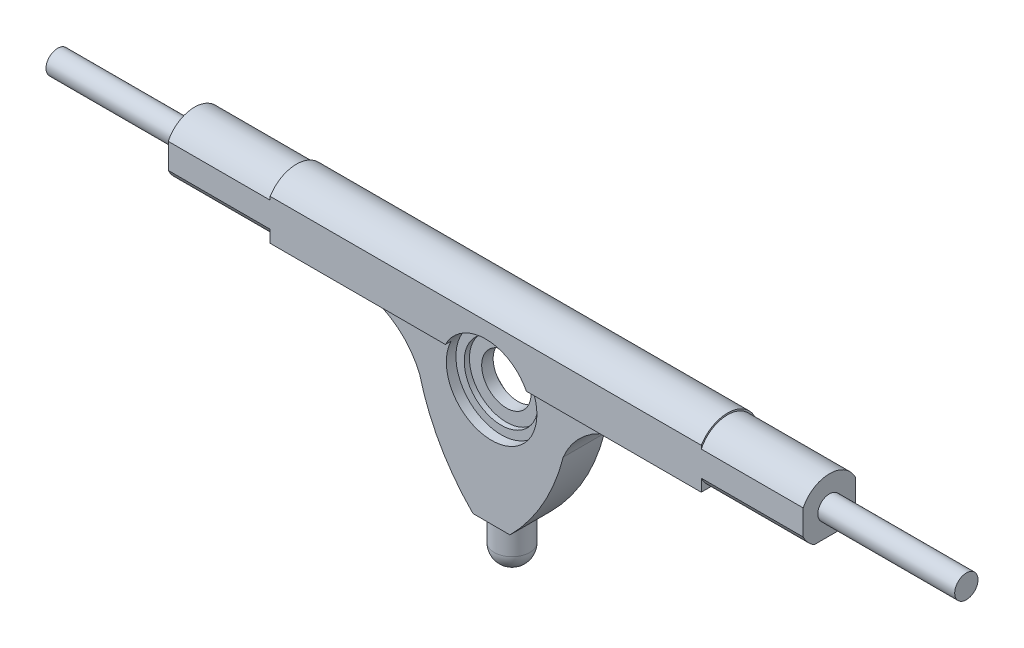
ISO-10303-21;
HEADER;
FILE_DESCRIPTION(('STEP AP214'),'2;1');
FILE_NAME('part.step','',(''),(''),'','','');
FILE_SCHEMA(('AUTOMOTIVE_DESIGN { 1 0 10303 214 1 1 1 1 }'));
ENDSEC;
DATA;
#1=APPLICATION_CONTEXT('core data for automotive mechanical design processes');
#2=APPLICATION_PROTOCOL_DEFINITION('international standard','automotive_design',2000,#1);
#3=PRODUCT_CONTEXT('',#1,'mechanical');
#4=PRODUCT('Part','Part','',(#3));
#5=PRODUCT_RELATED_PRODUCT_CATEGORY('part','',(#4));
#6=PRODUCT_DEFINITION_FORMATION('','',#4);
#7=PRODUCT_DEFINITION_CONTEXT('part definition',#1,'design');
#8=PRODUCT_DEFINITION('design','',#6,#7);
#9=PRODUCT_DEFINITION_SHAPE('','',#8);
#10=(LENGTH_UNIT() NAMED_UNIT(*) SI_UNIT(.MILLI.,.METRE.));
#11=(NAMED_UNIT(*) PLANE_ANGLE_UNIT() SI_UNIT($,.RADIAN.));
#12=(NAMED_UNIT(*) SI_UNIT($,.STERADIAN.) SOLID_ANGLE_UNIT());
#13=UNCERTAINTY_MEASURE_WITH_UNIT(LENGTH_MEASURE(1.E-05),#10,'distance_accuracy_value','');
#14=(GEOMETRIC_REPRESENTATION_CONTEXT(3) GLOBAL_UNCERTAINTY_ASSIGNED_CONTEXT((#13)) GLOBAL_UNIT_ASSIGNED_CONTEXT((#10,
#11,#12)) REPRESENTATION_CONTEXT('',''));
#15=CARTESIAN_POINT('',(0.,0.,0.));
#16=DIRECTION('',(0.,0.,1.));
#17=DIRECTION('',(1.,0.,0.));
#18=AXIS2_PLACEMENT_3D('',#15,#16,#17);
#19=CARTESIAN_POINT('',(109.,1.5224125,0.));
#20=DIRECTION('',(-1.,0.,0.));
#21=DIRECTION('',(0.,0.,1.));
#22=AXIS2_PLACEMENT_3D('',#19,#20,#21);
#23=CYLINDRICAL_SURFACE('',#22,10.5425875);
#24=CARTESIAN_POINT('',(-74.,1.5224125,0.));
#25=DIRECTION('',(-1.,0.,0.));
#26=DIRECTION('',(0.,0.,1.));
#27=AXIS2_PLACEMENT_3D('',#24,#25,#26);
#28=CIRCLE('',#27,10.5425875);
#29=CARTESIAN_POINT('',(-74.,6.985,9.017));
#30=VERTEX_POINT('',#29);
#31=CARTESIAN_POINT('',(-74.,6.985,-9.017));
#32=VERTEX_POINT('',#31);
#33=EDGE_CURVE('E229',#30,#32,#28,.T.);
#34=ORIENTED_EDGE('',*,*,#33,.F.);
#35=DIRECTION('',(-1.,0.,0.));
#36=VECTOR('',#35,1.);
#37=CARTESIAN_POINT('',(109.,6.985,9.017));
#38=LINE('',#37,#36);
#39=CARTESIAN_POINT('',(74.,6.985,9.017));
#40=VERTEX_POINT('',#39);
#41=EDGE_CURVE('E433',#40,#30,#38,.T.);
#42=ORIENTED_EDGE('',*,*,#41,.F.);
#43=CARTESIAN_POINT('',(74.,1.5224125,0.));
#44=DIRECTION('',(1.,0.,0.));
#45=DIRECTION('',(0.,0.,-1.));
#46=AXIS2_PLACEMENT_3D('',#43,#44,#45);
#47=CIRCLE('',#46,10.5425875);
#48=CARTESIAN_POINT('',(74.,6.985,-9.017));
#49=VERTEX_POINT('',#48);
#50=EDGE_CURVE('E282',#49,#40,#47,.T.);
#51=ORIENTED_EDGE('',*,*,#50,.F.);
#52=DIRECTION('',(-1.,0.,0.));
#53=VECTOR('',#52,1.);
#54=CARTESIAN_POINT('',(109.,6.985,-9.017));
#55=LINE('',#54,#53);
#56=EDGE_CURVE('E455',#49,#32,#55,.T.);
#57=ORIENTED_EDGE('',*,*,#56,.T.);
#58=EDGE_LOOP('',(#34,#42,#51,#57));
#59=FACE_BOUND('',#58,.T.);
#60=ADVANCED_FACE('F50',(#59),#23,.T.);
#61=CARTESIAN_POINT('',(109.,-6.985,9.017));
#62=DIRECTION('',(0.,0.,-1.));
#63=DIRECTION('',(-1.,0.,0.));
#64=AXIS2_PLACEMENT_3D('',#61,#62,#63);
#65=PLANE('',#64);
#66=DIRECTION('',(0.,1.,0.));
#67=VECTOR('',#66,1.);
#68=CARTESIAN_POINT('',(-74.,-6.985,9.017));
#69=LINE('',#68,#67);
#70=CARTESIAN_POINT('',(-74.,-6.985,9.017));
#71=VERTEX_POINT('',#70);
#72=CARTESIAN_POINT('',(-74.,-2.80120993957541,9.017));
#73=VERTEX_POINT('',#72);
#74=EDGE_CURVE('E258',#71,#73,#69,.T.);
#75=ORIENTED_EDGE('',*,*,#74,.F.);
#76=DIRECTION('',(-1.,0.,0.));
#77=VECTOR('',#76,1.);
#78=CARTESIAN_POINT('',(109.,-6.985,9.017));
#79=LINE('',#78,#77);
#80=CARTESIAN_POINT('',(-13.8470055256227,-6.985,9.017));
#81=VERTEX_POINT('',#80);
#82=EDGE_CURVE('E465',#81,#71,#79,.T.);
#83=ORIENTED_EDGE('',*,*,#82,.F.);
#84=CARTESIAN_POINT('',(0.0506239634080682,-13.9772600663607,9.017));
#85=DIRECTION('',(0.,0.,1.));
#86=DIRECTION('',(1.,0.,0.));
#87=AXIS2_PLACEMENT_3D('',#84,#85,#86);
#88=CIRCLE('',#87,15.5575);
#89=CARTESIAN_POINT('',(13.9482534524388,-6.985,9.017));
#90=VERTEX_POINT('',#89);
#91=EDGE_CURVE('E331',#90,#81,#88,.T.);
#92=ORIENTED_EDGE('',*,*,#91,.F.);
#93=CARTESIAN_POINT('',(74.,-6.985,9.017));
#94=VERTEX_POINT('',#93);
#95=EDGE_CURVE('E466',#94,#90,#79,.T.);
#96=ORIENTED_EDGE('',*,*,#95,.F.);
#97=DIRECTION('',(0.,-1.,0.));
#98=VECTOR('',#97,1.);
#99=CARTESIAN_POINT('',(74.,-6.985,9.017));
#100=LINE('',#99,#98);
#101=CARTESIAN_POINT('',(74.,-2.80120993957541,9.017));
#102=VERTEX_POINT('',#101);
#103=EDGE_CURVE('E287',#102,#94,#100,.T.);
#104=ORIENTED_EDGE('',*,*,#103,.F.);
#105=DIRECTION('',(1.,0.,0.));
#106=VECTOR('',#105,1.);
#107=CARTESIAN_POINT('',(74.,-2.80120993957541,9.017));
#108=LINE('',#107,#106);
#109=CARTESIAN_POINT('',(109.,-2.80120993957541,9.017));
#110=VERTEX_POINT('',#109);
#111=EDGE_CURVE('E274',#110,#102,#108,.F.);
#112=ORIENTED_EDGE('',*,*,#111,.F.);
#113=DIRECTION('',(0.,-1.,0.));
#114=VECTOR('',#113,1.);
#115=CARTESIAN_POINT('',(109.,-6.985,9.017));
#116=LINE('',#115,#114);
#117=CARTESIAN_POINT('',(109.,5.84603493957541,9.017));
#118=VERTEX_POINT('',#117);
#119=EDGE_CURVE('E446',#118,#110,#116,.T.);
#120=ORIENTED_EDGE('',*,*,#119,.F.);
#121=DIRECTION('',(1.,0.,0.));
#122=VECTOR('',#121,1.);
#123=CARTESIAN_POINT('',(74.,5.84603493957541,9.017));
#124=LINE('',#123,#122);
#125=CARTESIAN_POINT('',(74.,5.84603493957541,9.017));
#126=VERTEX_POINT('',#125);
#127=EDGE_CURVE('E276',#126,#118,#124,.T.);
#128=ORIENTED_EDGE('',*,*,#127,.F.);
#129=EDGE_CURVE('E284',#40,#126,#100,.T.);
#130=ORIENTED_EDGE('',*,*,#129,.F.);
#131=ORIENTED_EDGE('',*,*,#41,.T.);
#132=CARTESIAN_POINT('',(-74.,5.84603493957541,9.017));
#133=VERTEX_POINT('',#132);
#134=EDGE_CURVE('E259',#133,#30,#69,.T.);
#135=ORIENTED_EDGE('',*,*,#134,.F.);
#136=DIRECTION('',(-1.,0.,0.));
#137=VECTOR('',#136,1.);
#138=CARTESIAN_POINT('',(-74.,5.84603493957541,9.017));
#139=LINE('',#138,#137);
#140=CARTESIAN_POINT('',(-109.,5.84603493957541,9.017));
#141=VERTEX_POINT('',#140);
#142=EDGE_CURVE('E241',#133,#141,#139,.T.);
#143=ORIENTED_EDGE('',*,*,#142,.T.);
#144=DIRECTION('',(0.,-1.,0.));
#145=VECTOR('',#144,1.);
#146=CARTESIAN_POINT('',(-109.,-6.985,9.017));
#147=LINE('',#146,#145);
#148=CARTESIAN_POINT('',(-109.,-2.80120993957541,9.017));
#149=VERTEX_POINT('',#148);
#150=EDGE_CURVE('E364',#141,#149,#147,.T.);
#151=ORIENTED_EDGE('',*,*,#150,.T.);
#152=DIRECTION('',(-1.,0.,0.));
#153=VECTOR('',#152,1.);
#154=CARTESIAN_POINT('',(-74.,-2.80120993957541,9.017));
#155=LINE('',#154,#153);
#156=EDGE_CURVE('E64',#149,#73,#155,.F.);
#157=ORIENTED_EDGE('',*,*,#156,.T.);
#158=EDGE_LOOP('',(#75,#83,#92,#96,#104,#112,#120,#128,#130,#131,#135,#143,#151,#157));
#159=FACE_BOUND('',#158,.T.);
#160=ADVANCED_FACE('F484',(#159),#65,.F.);
#161=CARTESIAN_POINT('',(109.,-6.985,-9.017));
#162=DIRECTION('',(0.,0.,1.));
#163=DIRECTION('',(1.,0.,0.));
#164=AXIS2_PLACEMENT_3D('',#161,#162,#163);
#165=PLANE('',#164);
#166=DIRECTION('',(0.,-1.,0.));
#167=VECTOR('',#166,1.);
#168=CARTESIAN_POINT('',(-74.,-6.985,-9.017));
#169=LINE('',#168,#167);
#170=CARTESIAN_POINT('',(-74.,5.84603493957541,-9.017));
#171=VERTEX_POINT('',#170);
#172=EDGE_CURVE('E223',#32,#171,#169,.T.);
#173=ORIENTED_EDGE('',*,*,#172,.F.);
#174=ORIENTED_EDGE('',*,*,#56,.F.);
#175=DIRECTION('',(0.,1.,0.));
#176=VECTOR('',#175,1.);
#177=CARTESIAN_POINT('',(74.,-6.985,-9.017));
#178=LINE('',#177,#176);
#179=CARTESIAN_POINT('',(74.,5.84603493957541,-9.017));
#180=VERTEX_POINT('',#179);
#181=EDGE_CURVE('E502',#180,#49,#178,.T.);
#182=ORIENTED_EDGE('',*,*,#181,.F.);
#183=DIRECTION('',(1.,0.,0.));
#184=VECTOR('',#183,1.);
#185=CARTESIAN_POINT('',(74.,5.84603493957541,-9.017));
#186=LINE('',#185,#184);
#187=CARTESIAN_POINT('',(109.,5.84603493957541,-9.017));
#188=VERTEX_POINT('',#187);
#189=EDGE_CURVE('E265',#188,#180,#186,.F.);
#190=ORIENTED_EDGE('',*,*,#189,.F.);
#191=DIRECTION('',(0.,1.,0.));
#192=VECTOR('',#191,1.);
#193=CARTESIAN_POINT('',(109.,-6.985,-9.017));
#194=LINE('',#193,#192);
#195=CARTESIAN_POINT('',(109.,-2.80120993957541,-9.017));
#196=VERTEX_POINT('',#195);
#197=EDGE_CURVE('E452',#196,#188,#194,.T.);
#198=ORIENTED_EDGE('',*,*,#197,.F.);
#199=DIRECTION('',(1.,0.,0.));
#200=VECTOR('',#199,1.);
#201=CARTESIAN_POINT('',(74.,-2.80120993957541,-9.017));
#202=LINE('',#201,#200);
#203=CARTESIAN_POINT('',(74.,-2.80120993957541,-9.017));
#204=VERTEX_POINT('',#203);
#205=EDGE_CURVE('E272',#204,#196,#202,.T.);
#206=ORIENTED_EDGE('',*,*,#205,.F.);
#207=CARTESIAN_POINT('',(74.,-6.985,-9.017));
#208=VERTEX_POINT('',#207);
#209=EDGE_CURVE('E501',#208,#204,#178,.T.);
#210=ORIENTED_EDGE('',*,*,#209,.F.);
#211=DIRECTION('',(-1.,0.,0.));
#212=VECTOR('',#211,1.);
#213=CARTESIAN_POINT('',(109.,-6.985,-9.017));
#214=LINE('',#213,#212);
#215=CARTESIAN_POINT('',(13.9482534524388,-6.985,-9.017));
#216=VERTEX_POINT('',#215);
#217=EDGE_CURVE('E464',#208,#216,#214,.T.);
#218=ORIENTED_EDGE('',*,*,#217,.T.);
#219=CARTESIAN_POINT('',(0.0506239634080682,-13.9772600663607,-9.017));
#220=DIRECTION('',(0.,0.,1.));
#221=DIRECTION('',(1.,0.,0.));
#222=AXIS2_PLACEMENT_3D('',#219,#220,#221);
#223=CIRCLE('',#222,15.5575);
#224=CARTESIAN_POINT('',(-13.8470055256227,-6.985,-9.017));
#225=VERTEX_POINT('',#224);
#226=EDGE_CURVE('E299',#216,#225,#223,.T.);
#227=ORIENTED_EDGE('',*,*,#226,.T.);
#228=CARTESIAN_POINT('',(-74.,-6.985,-9.017));
#229=VERTEX_POINT('',#228);
#230=EDGE_CURVE('E463',#225,#229,#214,.T.);
#231=ORIENTED_EDGE('',*,*,#230,.T.);
#232=CARTESIAN_POINT('',(-74.,-2.80120993957541,-9.017));
#233=VERTEX_POINT('',#232);
#234=EDGE_CURVE('E234',#233,#229,#169,.T.);
#235=ORIENTED_EDGE('',*,*,#234,.F.);
#236=DIRECTION('',(-1.,0.,0.));
#237=VECTOR('',#236,1.);
#238=CARTESIAN_POINT('',(-74.,-2.80120993957541,-9.017));
#239=LINE('',#238,#237);
#240=CARTESIAN_POINT('',(-109.,-2.80120993957541,-9.017));
#241=VERTEX_POINT('',#240);
#242=EDGE_CURVE('E251',#233,#241,#239,.T.);
#243=ORIENTED_EDGE('',*,*,#242,.T.);
#244=DIRECTION('',(0.,1.,0.));
#245=VECTOR('',#244,1.);
#246=CARTESIAN_POINT('',(-109.,-6.985,-9.017));
#247=LINE('',#246,#245);
#248=CARTESIAN_POINT('',(-109.,5.84603493957541,-9.017));
#249=VERTEX_POINT('',#248);
#250=EDGE_CURVE('E250',#241,#249,#247,.T.);
#251=ORIENTED_EDGE('',*,*,#250,.T.);
#252=DIRECTION('',(-1.,0.,0.));
#253=VECTOR('',#252,1.);
#254=CARTESIAN_POINT('',(-74.,5.84603493957541,-9.017));
#255=LINE('',#254,#253);
#256=EDGE_CURVE('E238',#249,#171,#255,.F.);
#257=ORIENTED_EDGE('',*,*,#256,.T.);
#258=EDGE_LOOP('',(#173,#174,#182,#190,#198,#206,#210,#218,#227,#231,#235,#243,#251,#257));
#259=FACE_BOUND('',#258,.T.);
#260=ADVANCED_FACE('F247',(#259),#165,.F.);
#261=CARTESIAN_POINT('',(109.,-6.985,9.017));
#262=DIRECTION('',(0.,1.,0.));
#263=DIRECTION('',(0.,0.,1.));
#264=AXIS2_PLACEMENT_3D('',#261,#262,#263);
#265=PLANE('',#264);
#266=DIRECTION('',(0.,0.,1.));
#267=VECTOR('',#266,1.);
#268=CARTESIAN_POINT('',(-74.,-6.985,9.017));
#269=LINE('',#268,#267);
#270=CARTESIAN_POINT('',(-74.,-6.985,-5.25584746304949));
#271=VERTEX_POINT('',#270);
#272=EDGE_CURVE('E14',#229,#271,#269,.T.);
#273=ORIENTED_EDGE('',*,*,#272,.F.);
#274=ORIENTED_EDGE('',*,*,#230,.F.);
#275=DIRECTION('',(0.,0.,1.));
#276=VECTOR('',#275,1.);
#277=CARTESIAN_POINT('',(-13.8470055256227,-6.985,55.7699492853136));
#278=LINE('',#277,#276);
#279=CARTESIAN_POINT('',(-13.8470055256227,-6.985,-7.04849999999999));
#280=VERTEX_POINT('',#279);
#281=EDGE_CURVE('E335',#280,#225,#278,.F.);
#282=ORIENTED_EDGE('',*,*,#281,.F.);
#283=DIRECTION('',(-1.,0.,0.));
#284=VECTOR('',#283,1.);
#285=CARTESIAN_POINT('',(-43.18,-6.985,-7.0485));
#286=LINE('',#285,#284);
#287=CARTESIAN_POINT('',(-43.18,-6.985,-7.0485));
#288=VERTEX_POINT('',#287);
#289=EDGE_CURVE('E420',#280,#288,#286,.T.);
#290=ORIENTED_EDGE('',*,*,#289,.T.);
#291=DIRECTION('',(0.,0.,1.));
#292=VECTOR('',#291,1.);
#293=CARTESIAN_POINT('',(-43.18,-6.985,-7.0485));
#294=LINE('',#293,#292);
#295=CARTESIAN_POINT('',(-43.18,-6.985,7.0485));
#296=VERTEX_POINT('',#295);
#297=EDGE_CURVE('E358',#288,#296,#294,.T.);
#298=ORIENTED_EDGE('',*,*,#297,.T.);
#299=DIRECTION('',(-1.,0.,0.));
#300=VECTOR('',#299,1.);
#301=CARTESIAN_POINT('',(-43.18,-6.985,7.0485));
#302=LINE('',#301,#300);
#303=CARTESIAN_POINT('',(-13.8470055256227,-6.985,7.04850000000001));
#304=VERTEX_POINT('',#303);
#305=EDGE_CURVE('E352',#304,#296,#302,.T.);
#306=ORIENTED_EDGE('',*,*,#305,.F.);
#307=DIRECTION('',(0.,0.,1.));
#308=VECTOR('',#307,1.);
#309=CARTESIAN_POINT('',(-13.8470055256227,-6.985,55.7699492853136));
#310=LINE('',#309,#308);
#311=EDGE_CURVE('E340',#81,#304,#310,.F.);
#312=ORIENTED_EDGE('',*,*,#311,.F.);
#313=ORIENTED_EDGE('',*,*,#82,.T.);
#314=CARTESIAN_POINT('',(-74.,-6.985,5.25584746304949));
#315=VERTEX_POINT('',#314);
#316=EDGE_CURVE('E53',#315,#71,#269,.T.);
#317=ORIENTED_EDGE('',*,*,#316,.F.);
#318=DIRECTION('',(-1.,0.,0.));
#319=VECTOR('',#318,1.);
#320=CARTESIAN_POINT('',(-74.,-6.985,5.25584746304949));
#321=LINE('',#320,#319);
#322=CARTESIAN_POINT('',(-109.,-6.985,5.25584746304949));
#323=VERTEX_POINT('',#322);
#324=EDGE_CURVE('E242',#315,#323,#321,.T.);
#325=ORIENTED_EDGE('',*,*,#324,.T.);
#326=DIRECTION('',(0.,0.,-1.));
#327=VECTOR('',#326,1.);
#328=CARTESIAN_POINT('',(-109.,-6.985,9.017));
#329=LINE('',#328,#327);
#330=CARTESIAN_POINT('',(-109.,-6.985,-5.25584746304949));
#331=VERTEX_POINT('',#330);
#332=EDGE_CURVE('E458',#323,#331,#329,.T.);
#333=ORIENTED_EDGE('',*,*,#332,.T.);
#334=DIRECTION('',(-1.,0.,0.));
#335=VECTOR('',#334,1.);
#336=CARTESIAN_POINT('',(-74.,-6.985,-5.25584746304949));
#337=LINE('',#336,#335);
#338=EDGE_CURVE('E72',#331,#271,#337,.F.);
#339=ORIENTED_EDGE('',*,*,#338,.T.);
#340=EDGE_LOOP('',(#273,#274,#282,#290,#298,#306,#312,#313,#317,#325,#333,#339));
#341=FACE_BOUND('',#340,.T.);
#342=ADVANCED_FACE('F478',(#341),#265,.F.);
#343=CARTESIAN_POINT('',(-109.,1.5224125,0.));
#344=DIRECTION('',(-1.,0.,0.));
#345=DIRECTION('',(0.,0.,1.));
#346=AXIS2_PLACEMENT_3D('',#343,#344,#345);
#347=PLANE('',#346);
#348=CARTESIAN_POINT('',(-109.,1.5224125,0.));
#349=DIRECTION('',(1.,0.,0.));
#350=DIRECTION('',(0.,0.,-1.));
#351=AXIS2_PLACEMENT_3D('',#348,#349,#350);
#352=CIRCLE('',#351,4.);
#353=CARTESIAN_POINT('',(-109.,1.5224125,-4.));
#354=VERTEX_POINT('',#353);
#355=EDGE_CURVE('E294',#354,#354,#352,.T.);
#356=ORIENTED_EDGE('',*,*,#355,.T.);
#357=EDGE_LOOP('',(#356));
#358=FACE_BOUND('',#357,.T.);
#359=CARTESIAN_POINT('',(-109.,1.5224125,0.));
#360=DIRECTION('',(-1.,0.,0.));
#361=DIRECTION('',(0.,0.,1.));
#362=AXIS2_PLACEMENT_3D('',#359,#360,#361);
#363=CIRCLE('',#362,10.);
#364=EDGE_CURVE('E499',#149,#323,#363,.F.);
#365=ORIENTED_EDGE('',*,*,#364,.F.);
#366=ORIENTED_EDGE('',*,*,#150,.F.);
#367=CARTESIAN_POINT('',(-109.,1.5224125,0.));
#368=DIRECTION('',(1.,0.,0.));
#369=DIRECTION('',(0.,0.,-1.));
#370=AXIS2_PLACEMENT_3D('',#367,#368,#369);
#371=CIRCLE('',#370,10.);
#372=EDGE_CURVE('E490',#249,#141,#371,.T.);
#373=ORIENTED_EDGE('',*,*,#372,.F.);
#374=ORIENTED_EDGE('',*,*,#250,.F.);
#375=EDGE_CURVE('E500',#331,#241,#363,.F.);
#376=ORIENTED_EDGE('',*,*,#375,.F.);
#377=ORIENTED_EDGE('',*,*,#332,.F.);
#378=EDGE_LOOP('',(#365,#366,#373,#374,#376,#377));
#379=FACE_BOUND('',#378,.T.);
#380=ADVANCED_FACE('F497',(#358,#379),#347,.T.);
#381=DIRECTION('',(0.,0.,-1.));
#382=VECTOR('',#381,1.);
#383=CARTESIAN_POINT('',(74.,-6.985,9.017));
#384=LINE('',#383,#382);
#385=CARTESIAN_POINT('',(74.,-6.985,5.25584746304949));
#386=VERTEX_POINT('',#385);
#387=EDGE_CURVE('E289',#94,#386,#384,.T.);
#388=ORIENTED_EDGE('',*,*,#387,.F.);
#389=ORIENTED_EDGE('',*,*,#95,.T.);
#390=DIRECTION('',(0.,0.,1.));
#391=VECTOR('',#390,1.);
#392=CARTESIAN_POINT('',(13.9482534524388,-6.985,55.7699492853136));
#393=LINE('',#392,#391);
#394=CARTESIAN_POINT('',(13.9482534524388,-6.985,7.04850000000001));
#395=VERTEX_POINT('',#394);
#396=EDGE_CURVE('E337',#395,#90,#393,.T.);
#397=ORIENTED_EDGE('',*,*,#396,.F.);
#398=CARTESIAN_POINT('',(43.18,-6.985,7.0485));
#399=VERTEX_POINT('',#398);
#400=EDGE_CURVE('E421',#399,#395,#302,.T.);
#401=ORIENTED_EDGE('',*,*,#400,.F.);
#402=DIRECTION('',(0.,0.,1.));
#403=VECTOR('',#402,1.);
#404=CARTESIAN_POINT('',(43.18,-6.985,-7.0485));
#405=LINE('',#404,#403);
#406=CARTESIAN_POINT('',(43.18,-6.985,-7.0485));
#407=VERTEX_POINT('',#406);
#408=EDGE_CURVE('E417',#407,#399,#405,.T.);
#409=ORIENTED_EDGE('',*,*,#408,.F.);
#410=CARTESIAN_POINT('',(13.9482534524388,-6.985,-7.04849999999999));
#411=VERTEX_POINT('',#410);
#412=EDGE_CURVE('E414',#407,#411,#286,.T.);
#413=ORIENTED_EDGE('',*,*,#412,.T.);
#414=DIRECTION('',(0.,0.,1.));
#415=VECTOR('',#414,1.);
#416=CARTESIAN_POINT('',(13.9482534524388,-6.985,55.7699492853136));
#417=LINE('',#416,#415);
#418=EDGE_CURVE('E333',#216,#411,#417,.T.);
#419=ORIENTED_EDGE('',*,*,#418,.F.);
#420=ORIENTED_EDGE('',*,*,#217,.F.);
#421=CARTESIAN_POINT('',(74.,-6.985,-5.25584746304949));
#422=VERTEX_POINT('',#421);
#423=EDGE_CURVE('E286',#422,#208,#384,.T.);
#424=ORIENTED_EDGE('',*,*,#423,.F.);
#425=DIRECTION('',(1.,0.,0.));
#426=VECTOR('',#425,1.);
#427=CARTESIAN_POINT('',(74.,-6.985,-5.25584746304949));
#428=LINE('',#427,#426);
#429=CARTESIAN_POINT('',(109.,-6.985,-5.25584746304949));
#430=VERTEX_POINT('',#429);
#431=EDGE_CURVE('E278',#430,#422,#428,.F.);
#432=ORIENTED_EDGE('',*,*,#431,.F.);
#433=DIRECTION('',(0.,0.,-1.));
#434=VECTOR('',#433,1.);
#435=CARTESIAN_POINT('',(109.,-6.985,9.017));
#436=LINE('',#435,#434);
#437=CARTESIAN_POINT('',(109.,-6.985,5.25584746304949));
#438=VERTEX_POINT('',#437);
#439=EDGE_CURVE('E449',#438,#430,#436,.T.);
#440=ORIENTED_EDGE('',*,*,#439,.F.);
#441=DIRECTION('',(1.,0.,0.));
#442=VECTOR('',#441,1.);
#443=CARTESIAN_POINT('',(74.,-6.985,5.25584746304949));
#444=LINE('',#443,#442);
#445=EDGE_CURVE('E280',#386,#438,#444,.T.);
#446=ORIENTED_EDGE('',*,*,#445,.F.);
#447=EDGE_LOOP('',(#388,#389,#397,#401,#409,#413,#419,#420,#424,#432,#440,#446));
#448=FACE_BOUND('',#447,.T.);
#449=ADVANCED_FACE('F519',(#448),#265,.F.);
#450=CARTESIAN_POINT('',(109.,1.5224125,0.));
#451=DIRECTION('',(-1.,0.,0.));
#452=DIRECTION('',(0.,0.,1.));
#453=AXIS2_PLACEMENT_3D('',#450,#451,#452);
#454=PLANE('',#453);
#455=CARTESIAN_POINT('',(109.,1.5224125,0.));
#456=DIRECTION('',(1.,0.,0.));
#457=DIRECTION('',(0.,0.,-1.));
#458=AXIS2_PLACEMENT_3D('',#455,#456,#457);
#459=CIRCLE('',#458,4.);
#460=CARTESIAN_POINT('',(109.,1.5224125,-4.));
#461=VERTEX_POINT('',#460);
#462=EDGE_CURVE('E300',#461,#461,#459,.T.);
#463=ORIENTED_EDGE('',*,*,#462,.F.);
#464=EDGE_LOOP('',(#463));
#465=FACE_BOUND('',#464,.T.);
#466=CARTESIAN_POINT('',(109.,1.5224125,0.));
#467=DIRECTION('',(1.,0.,0.));
#468=DIRECTION('',(0.,0.,-1.));
#469=AXIS2_PLACEMENT_3D('',#466,#467,#468);
#470=CIRCLE('',#469,10.);
#471=EDGE_CURVE('E268',#188,#118,#470,.T.);
#472=ORIENTED_EDGE('',*,*,#471,.T.);
#473=ORIENTED_EDGE('',*,*,#119,.T.);
#474=CARTESIAN_POINT('',(109.,1.5224125,0.));
#475=DIRECTION('',(-1.,0.,0.));
#476=DIRECTION('',(0.,0.,1.));
#477=AXIS2_PLACEMENT_3D('',#474,#475,#476);
#478=CIRCLE('',#477,10.);
#479=EDGE_CURVE('E303',#438,#110,#478,.T.);
#480=ORIENTED_EDGE('',*,*,#479,.F.);
#481=ORIENTED_EDGE('',*,*,#439,.T.);
#482=EDGE_CURVE('E504',#196,#430,#478,.T.);
#483=ORIENTED_EDGE('',*,*,#482,.F.);
#484=ORIENTED_EDGE('',*,*,#197,.T.);
#485=EDGE_LOOP('',(#472,#473,#480,#481,#483,#484));
#486=FACE_BOUND('',#485,.T.);
#487=ADVANCED_FACE('F522',(#465,#486),#454,.F.);
#488=CARTESIAN_POINT('',(0.,0.,7.04850000000001));
#489=DIRECTION('',(0.,0.,1.));
#490=DIRECTION('',(1.,0.,0.));
#491=AXIS2_PLACEMENT_3D('',#488,#489,#490);
#492=PLANE('',#491);
#493=ORIENTED_EDGE('',*,*,#400,.T.);
#494=CARTESIAN_POINT('',(0.0506239634080682,-13.9772600663607,7.04850000000001));
#495=DIRECTION('',(0.,0.,1.));
#496=DIRECTION('',(1.,0.,0.));
#497=AXIS2_PLACEMENT_3D('',#494,#495,#496);
#498=CIRCLE('',#497,15.5575);
#499=EDGE_CURVE('E304',#395,#304,#498,.F.);
#500=ORIENTED_EDGE('',*,*,#499,.T.);
#501=ORIENTED_EDGE('',*,*,#305,.T.);
#502=CARTESIAN_POINT('',(-48.1234864990168,-31.8992919071371,7.0485));
#503=DIRECTION('',(0.,0.,-1.));
#504=DIRECTION('',(-1.,0.,0.));
#505=AXIS2_PLACEMENT_3D('',#502,#503,#504);
#506=CIRCLE('',#505,25.4);
#507=CARTESIAN_POINT('',(-24.638,-22.225,7.0485));
#508=VERTEX_POINT('',#507);
#509=EDGE_CURVE('E348',#296,#508,#506,.T.);
#510=ORIENTED_EDGE('',*,*,#509,.T.);
#511=CARTESIAN_POINT('',(43.09050551181,-5.14073703267465,7.0485));
#512=DIRECTION('',(0.,0.,1.));
#513=DIRECTION('',(1.,0.,0.));
#514=AXIS2_PLACEMENT_3D('',#511,#512,#513);
#515=CIRCLE('',#514,69.85);
#516=CARTESIAN_POINT('',(-6.35,-54.483,7.0485));
#517=VERTEX_POINT('',#516);
#518=EDGE_CURVE('E365',#508,#517,#515,.T.);
#519=ORIENTED_EDGE('',*,*,#518,.T.);
#520=DIRECTION('',(1.,0.,0.));
#521=VECTOR('',#520,1.);
#522=CARTESIAN_POINT('',(6.35,-54.483,7.0485));
#523=LINE('',#522,#521);
#524=CARTESIAN_POINT('',(6.35,-54.483,7.0485));
#525=VERTEX_POINT('',#524);
#526=EDGE_CURVE('E372',#517,#525,#523,.T.);
#527=ORIENTED_EDGE('',*,*,#526,.T.);
#528=CARTESIAN_POINT('',(-43.09050551181,-5.14073703267465,7.0485));
#529=DIRECTION('',(0.,0.,1.));
#530=DIRECTION('',(-1.,0.,0.));
#531=AXIS2_PLACEMENT_3D('',#528,#529,#530);
#532=CIRCLE('',#531,69.85);
#533=CARTESIAN_POINT('',(24.638,-22.225,7.0485));
#534=VERTEX_POINT('',#533);
#535=EDGE_CURVE('E392',#525,#534,#532,.T.);
#536=ORIENTED_EDGE('',*,*,#535,.T.);
#537=CARTESIAN_POINT('',(48.1234864990168,-31.8992919071371,7.0485));
#538=DIRECTION('',(0.,0.,-1.));
#539=DIRECTION('',(1.,0.,0.));
#540=AXIS2_PLACEMENT_3D('',#537,#538,#539);
#541=CIRCLE('',#540,25.4);
#542=EDGE_CURVE('E406',#534,#399,#541,.T.);
#543=ORIENTED_EDGE('',*,*,#542,.T.);
#544=EDGE_LOOP('',(#493,#500,#501,#510,#519,#527,#536,#543));
#545=FACE_BOUND('',#544,.T.);
#546=ADVANCED_FACE('F560',(#545),#492,.T.);
#547=CARTESIAN_POINT('',(0.,0.,-7.04849999999999));
#548=DIRECTION('',(0.,0.,1.));
#549=DIRECTION('',(1.,0.,0.));
#550=AXIS2_PLACEMENT_3D('',#547,#548,#549);
#551=PLANE('',#550);
#552=CARTESIAN_POINT('',(0.0506239634080682,-13.9772600663607,-7.04849999999999));
#553=DIRECTION('',(0.,0.,1.));
#554=DIRECTION('',(1.,0.,0.));
#555=AXIS2_PLACEMENT_3D('',#552,#553,#554);
#556=CIRCLE('',#555,15.5575);
#557=EDGE_CURVE('E435',#411,#280,#556,.F.);
#558=ORIENTED_EDGE('',*,*,#557,.F.);
#559=ORIENTED_EDGE('',*,*,#412,.F.);
#560=CARTESIAN_POINT('',(48.1234864990168,-31.8992919071371,-7.0485));
#561=DIRECTION('',(0.,0.,-1.));
#562=DIRECTION('',(1.,0.,0.));
#563=AXIS2_PLACEMENT_3D('',#560,#561,#562);
#564=CIRCLE('',#563,25.4);
#565=CARTESIAN_POINT('',(24.638,-22.225,-7.0485));
#566=VERTEX_POINT('',#565);
#567=EDGE_CURVE('E400',#566,#407,#564,.T.);
#568=ORIENTED_EDGE('',*,*,#567,.F.);
#569=CARTESIAN_POINT('',(-43.09050551181,-5.14073703267465,-7.0485));
#570=DIRECTION('',(0.,0.,1.));
#571=DIRECTION('',(-1.,0.,0.));
#572=AXIS2_PLACEMENT_3D('',#569,#570,#571);
#573=CIRCLE('',#572,69.85);
#574=CARTESIAN_POINT('',(6.35,-54.483,-7.0485));
#575=VERTEX_POINT('',#574);
#576=EDGE_CURVE('E386',#575,#566,#573,.T.);
#577=ORIENTED_EDGE('',*,*,#576,.F.);
#578=DIRECTION('',(1.,0.,0.));
#579=VECTOR('',#578,1.);
#580=CARTESIAN_POINT('',(6.35,-54.483,-7.0485));
#581=LINE('',#580,#579);
#582=CARTESIAN_POINT('',(-6.35,-54.483,-7.0485));
#583=VERTEX_POINT('',#582);
#584=EDGE_CURVE('E371',#583,#575,#581,.T.);
#585=ORIENTED_EDGE('',*,*,#584,.F.);
#586=CARTESIAN_POINT('',(43.09050551181,-5.14073703267465,-7.0485));
#587=DIRECTION('',(0.,0.,1.));
#588=DIRECTION('',(1.,0.,0.));
#589=AXIS2_PLACEMENT_3D('',#586,#587,#588);
#590=CIRCLE('',#589,69.85);
#591=CARTESIAN_POINT('',(-24.638,-22.225,-7.0485));
#592=VERTEX_POINT('',#591);
#593=EDGE_CURVE('E361',#592,#583,#590,.T.);
#594=ORIENTED_EDGE('',*,*,#593,.F.);
#595=CARTESIAN_POINT('',(-48.1234864990168,-31.8992919071371,-7.0485));
#596=DIRECTION('',(0.,0.,-1.));
#597=DIRECTION('',(-1.,0.,0.));
#598=AXIS2_PLACEMENT_3D('',#595,#596,#597);
#599=CIRCLE('',#598,25.4);
#600=EDGE_CURVE('E353',#288,#592,#599,.T.);
#601=ORIENTED_EDGE('',*,*,#600,.F.);
#602=ORIENTED_EDGE('',*,*,#289,.F.);
#603=EDGE_LOOP('',(#558,#559,#568,#577,#585,#594,#601,#602));
#604=FACE_BOUND('',#603,.T.);
#605=ADVANCED_FACE('F565',(#604),#551,.F.);
#606=CARTESIAN_POINT('',(-48.1234864990168,-31.8992919071371,-7.0485));
#607=DIRECTION('',(0.,0.,1.));
#608=DIRECTION('',(1.,0.,0.));
#609=AXIS2_PLACEMENT_3D('',#606,#607,#608);
#610=CYLINDRICAL_SURFACE('',#609,25.4);
#611=ORIENTED_EDGE('',*,*,#509,.F.);
#612=ORIENTED_EDGE('',*,*,#297,.F.);
#613=ORIENTED_EDGE('',*,*,#600,.T.);
#614=DIRECTION('',(0.,0.,1.));
#615=VECTOR('',#614,1.);
#616=CARTESIAN_POINT('',(-24.638,-22.225,-7.0485));
#617=LINE('',#616,#615);
#618=EDGE_CURVE('E349',#592,#508,#617,.T.);
#619=ORIENTED_EDGE('',*,*,#618,.T.);
#620=EDGE_LOOP('',(#611,#612,#613,#619));
#621=FACE_BOUND('',#620,.T.);
#622=ADVANCED_FACE('F570',(#621),#610,.F.);
#623=CARTESIAN_POINT('',(48.1234864990168,-31.8992919071371,-7.0485));
#624=DIRECTION('',(0.,0.,1.));
#625=DIRECTION('',(1.,0.,0.));
#626=AXIS2_PLACEMENT_3D('',#623,#624,#625);
#627=CYLINDRICAL_SURFACE('',#626,25.4);
#628=ORIENTED_EDGE('',*,*,#542,.F.);
#629=DIRECTION('',(0.,0.,1.));
#630=VECTOR('',#629,1.);
#631=CARTESIAN_POINT('',(24.638,-22.225,-7.0485));
#632=LINE('',#631,#630);
#633=EDGE_CURVE('E403',#566,#534,#632,.T.);
#634=ORIENTED_EDGE('',*,*,#633,.F.);
#635=ORIENTED_EDGE('',*,*,#567,.T.);
#636=ORIENTED_EDGE('',*,*,#408,.T.);
#637=EDGE_LOOP('',(#628,#634,#635,#636));
#638=FACE_BOUND('',#637,.T.);
#639=ADVANCED_FACE('F582',(#638),#627,.F.);
#640=CARTESIAN_POINT('',(-43.09050551181,-5.14073703267465,-7.0485));
#641=DIRECTION('',(0.,0.,1.));
#642=DIRECTION('',(1.,0.,0.));
#643=AXIS2_PLACEMENT_3D('',#640,#641,#642);
#644=CYLINDRICAL_SURFACE('',#643,69.85);
#645=ORIENTED_EDGE('',*,*,#535,.F.);
#646=DIRECTION('',(0.,0.,1.));
#647=VECTOR('',#646,1.);
#648=CARTESIAN_POINT('',(6.35,-54.483,-7.0485));
#649=LINE('',#648,#647);
#650=EDGE_CURVE('E389',#575,#525,#649,.T.);
#651=ORIENTED_EDGE('',*,*,#650,.F.);
#652=ORIENTED_EDGE('',*,*,#576,.T.);
#653=ORIENTED_EDGE('',*,*,#633,.T.);
#654=EDGE_LOOP('',(#645,#651,#652,#653));
#655=FACE_BOUND('',#654,.T.);
#656=ADVANCED_FACE('F578',(#655),#644,.T.);
#657=CARTESIAN_POINT('',(6.35,-54.483,-7.0485));
#658=DIRECTION('',(0.,-1.,0.));
#659=DIRECTION('',(0.,0.,-1.));
#660=AXIS2_PLACEMENT_3D('',#657,#658,#659);
#661=PLANE('',#660);
#662=CARTESIAN_POINT('',(0.,-54.483,0.));
#663=DIRECTION('',(0.,1.,0.));
#664=DIRECTION('',(-1.,0.,0.));
#665=AXIS2_PLACEMENT_3D('',#662,#663,#664);
#666=CIRCLE('',#665,6.096);
#667=CARTESIAN_POINT('',(-6.096,-54.483,0.));
#668=VERTEX_POINT('',#667);
#669=EDGE_CURVE('E345',#668,#668,#666,.T.);
#670=ORIENTED_EDGE('',*,*,#669,.T.);
#671=EDGE_LOOP('',(#670));
#672=FACE_BOUND('',#671,.T.);
#673=ORIENTED_EDGE('',*,*,#526,.F.);
#674=DIRECTION('',(0.,0.,1.));
#675=VECTOR('',#674,1.);
#676=CARTESIAN_POINT('',(-6.35,-54.483,-7.0485));
#677=LINE('',#676,#675);
#678=EDGE_CURVE('E368',#583,#517,#677,.T.);
#679=ORIENTED_EDGE('',*,*,#678,.F.);
#680=ORIENTED_EDGE('',*,*,#584,.T.);
#681=ORIENTED_EDGE('',*,*,#650,.T.);
#682=EDGE_LOOP('',(#673,#679,#680,#681));
#683=FACE_BOUND('',#682,.T.);
#684=ADVANCED_FACE('F574',(#672,#683),#661,.T.);
#685=CARTESIAN_POINT('',(43.09050551181,-5.14073703267465,-7.0485));
#686=DIRECTION('',(0.,0.,1.));
#687=DIRECTION('',(1.,0.,0.));
#688=AXIS2_PLACEMENT_3D('',#685,#686,#687);
#689=CYLINDRICAL_SURFACE('',#688,69.85);
#690=ORIENTED_EDGE('',*,*,#518,.F.);
#691=ORIENTED_EDGE('',*,*,#618,.F.);
#692=ORIENTED_EDGE('',*,*,#593,.T.);
#693=ORIENTED_EDGE('',*,*,#678,.T.);
#694=EDGE_LOOP('',(#690,#691,#692,#693));
#695=FACE_BOUND('',#694,.T.);
#696=ADVANCED_FACE('F562',(#695),#689,.T.);
#697=CARTESIAN_POINT('',(0.,-63.373,0.));
#698=DIRECTION('',(0.,1.,0.));
#699=DIRECTION('',(1.,0.,0.));
#700=AXIS2_PLACEMENT_3D('',#697,#698,#699);
#701=SPHERICAL_SURFACE('',#700,6.096);
#702=CARTESIAN_POINT('',(0.,-63.373,0.));
#703=DIRECTION('',(0.,1.,0.));
#704=DIRECTION('',(-1.,0.,0.));
#705=AXIS2_PLACEMENT_3D('',#702,#703,#704);
#706=CIRCLE('',#705,6.096);
#707=CARTESIAN_POINT('',(-6.096,-63.373,0.));
#708=VERTEX_POINT('',#707);
#709=EDGE_CURVE('E342',#708,#708,#706,.T.);
#710=ORIENTED_EDGE('',*,*,#709,.F.);
#711=EDGE_LOOP('',(#710));
#712=FACE_BOUND('',#711,.T.);
#713=ADVANCED_FACE('F567',(#712),#701,.T.);
#714=CARTESIAN_POINT('',(0.,-47.1341988320855,0.));
#715=DIRECTION('',(0.,1.,0.));
#716=DIRECTION('',(-1.,0.,0.));
#717=AXIS2_PLACEMENT_3D('',#714,#715,#716);
#718=CYLINDRICAL_SURFACE('',#717,6.096);
#719=ORIENTED_EDGE('',*,*,#669,.F.);
#720=EDGE_LOOP('',(#719));
#721=FACE_BOUND('',#720,.T.);
#722=ORIENTED_EDGE('',*,*,#709,.T.);
#723=EDGE_LOOP('',(#722));
#724=FACE_BOUND('',#723,.T.);
#725=ADVANCED_FACE('F592',(#721,#724),#718,.T.);
#726=CARTESIAN_POINT('',(0.0506239634080682,-13.9772600663607,55.7699492853136));
#727=DIRECTION('',(0.,0.,1.));
#728=DIRECTION('',(1.,0.,0.));
#729=AXIS2_PLACEMENT_3D('',#726,#727,#728);
#730=CYLINDRICAL_SURFACE('',#729,15.5575);
#731=CARTESIAN_POINT('',(0.0506239634080682,-13.9772600663607,3.7465));
#732=DIRECTION('',(0.,0.,1.));
#733=DIRECTION('',(1.,0.,0.));
#734=AXIS2_PLACEMENT_3D('',#731,#732,#733);
#735=CIRCLE('',#734,15.5575);
#736=CARTESIAN_POINT('',(15.6081239634081,-13.9772600663607,3.7465));
#737=VERTEX_POINT('',#736);
#738=EDGE_CURVE('E328',#737,#737,#735,.T.);
#739=ORIENTED_EDGE('',*,*,#738,.F.);
#740=EDGE_LOOP('',(#739));
#741=FACE_BOUND('',#740,.T.);
#742=ORIENTED_EDGE('',*,*,#311,.T.);
#743=ORIENTED_EDGE('',*,*,#499,.F.);
#744=ORIENTED_EDGE('',*,*,#396,.T.);
#745=ORIENTED_EDGE('',*,*,#91,.T.);
#746=EDGE_LOOP('',(#742,#743,#744,#745));
#747=FACE_BOUND('',#746,.T.);
#748=ADVANCED_FACE('F596',(#741,#747),#730,.F.);
#749=CARTESIAN_POINT('',(0.0506239634080682,-13.9772600663607,55.7699492853136));
#750=DIRECTION('',(0.,0.,1.));
#751=DIRECTION('',(1.,0.,0.));
#752=AXIS2_PLACEMENT_3D('',#749,#750,#751);
#753=CYLINDRICAL_SURFACE('',#752,15.5575);
#754=CARTESIAN_POINT('',(0.0506239634080682,-13.9772600663607,-3.7465));
#755=DIRECTION('',(0.,0.,1.));
#756=DIRECTION('',(1.,0.,0.));
#757=AXIS2_PLACEMENT_3D('',#754,#755,#756);
#758=CIRCLE('',#757,15.5575);
#759=CARTESIAN_POINT('',(15.6081239634081,-13.9772600663607,-3.7465));
#760=VERTEX_POINT('',#759);
#761=EDGE_CURVE('E307',#760,#760,#758,.T.);
#762=ORIENTED_EDGE('',*,*,#761,.T.);
#763=EDGE_LOOP('',(#762));
#764=FACE_BOUND('',#763,.T.);
#765=ORIENTED_EDGE('',*,*,#281,.T.);
#766=ORIENTED_EDGE('',*,*,#226,.F.);
#767=ORIENTED_EDGE('',*,*,#418,.T.);
#768=ORIENTED_EDGE('',*,*,#557,.T.);
#769=EDGE_LOOP('',(#765,#766,#767,#768));
#770=FACE_BOUND('',#769,.T.);
#771=ADVANCED_FACE('F600',(#764,#770),#753,.F.);
#772=CARTESIAN_POINT('',(15.6081239634081,-13.9772600663607,3.7465));
#773=DIRECTION('',(0.,0.,1.));
#774=DIRECTION('',(1.,0.,0.));
#775=AXIS2_PLACEMENT_3D('',#772,#773,#774);
#776=PLANE('',#775);
#777=ORIENTED_EDGE('',*,*,#738,.T.);
#778=EDGE_LOOP('',(#777));
#779=FACE_BOUND('',#778,.T.);
#780=CARTESIAN_POINT('',(0.0506239634080682,-13.9772600663607,3.7465));
#781=DIRECTION('',(0.,0.,1.));
#782=DIRECTION('',(1.,0.,0.));
#783=AXIS2_PLACEMENT_3D('',#780,#781,#782);
#784=CIRCLE('',#783,12.7);
#785=CARTESIAN_POINT('',(12.7506239634081,-13.9772600663607,3.7465));
#786=VERTEX_POINT('',#785);
#787=EDGE_CURVE('E325',#786,#786,#784,.T.);
#788=ORIENTED_EDGE('',*,*,#787,.F.);
#789=EDGE_LOOP('',(#788));
#790=FACE_BOUND('',#789,.T.);
#791=ADVANCED_FACE('F602',(#779,#790),#776,.T.);
#792=CARTESIAN_POINT('',(0.0506239634080682,-13.9772600663607,55.7699492853136));
#793=DIRECTION('',(0.,0.,1.));
#794=DIRECTION('',(1.,0.,0.));
#795=AXIS2_PLACEMENT_3D('',#792,#793,#794);
#796=CYLINDRICAL_SURFACE('',#795,12.7);
#797=ORIENTED_EDGE('',*,*,#787,.T.);
#798=EDGE_LOOP('',(#797));
#799=FACE_BOUND('',#798,.T.);
#800=CARTESIAN_POINT('',(0.0506239634080682,-13.9772600663607,1.9685));
#801=DIRECTION('',(0.,0.,1.));
#802=DIRECTION('',(1.,0.,0.));
#803=AXIS2_PLACEMENT_3D('',#800,#801,#802);
#804=CIRCLE('',#803,12.7);
#805=CARTESIAN_POINT('',(12.7506239634081,-13.9772600663607,1.9685));
#806=VERTEX_POINT('',#805);
#807=EDGE_CURVE('E322',#806,#806,#804,.T.);
#808=ORIENTED_EDGE('',*,*,#807,.F.);
#809=EDGE_LOOP('',(#808));
#810=FACE_BOUND('',#809,.T.);
#811=ADVANCED_FACE('F605',(#799,#810),#796,.F.);
#812=CARTESIAN_POINT('',(12.7506239634081,-13.9772600663607,1.9685));
#813=DIRECTION('',(0.,0.,1.));
#814=DIRECTION('',(1.,0.,0.));
#815=AXIS2_PLACEMENT_3D('',#812,#813,#814);
#816=PLANE('',#815);
#817=ORIENTED_EDGE('',*,*,#807,.T.);
#818=EDGE_LOOP('',(#817));
#819=FACE_BOUND('',#818,.T.);
#820=CARTESIAN_POINT('',(0.0506239634080682,-13.9772600663607,1.9685));
#821=DIRECTION('',(0.,0.,1.));
#822=DIRECTION('',(1.,0.,0.));
#823=AXIS2_PLACEMENT_3D('',#820,#821,#822);
#824=CIRCLE('',#823,8.4836);
#825=CARTESIAN_POINT('',(8.53422396340807,-13.9772600663607,1.9685));
#826=VERTEX_POINT('',#825);
#827=EDGE_CURVE('E319',#826,#826,#824,.T.);
#828=ORIENTED_EDGE('',*,*,#827,.F.);
#829=EDGE_LOOP('',(#828));
#830=FACE_BOUND('',#829,.T.);
#831=ADVANCED_FACE('F609',(#819,#830),#816,.T.);
#832=CARTESIAN_POINT('',(0.0506239634080682,-13.9772600663607,55.7699492853136));
#833=DIRECTION('',(0.,0.,1.));
#834=DIRECTION('',(1.,0.,0.));
#835=AXIS2_PLACEMENT_3D('',#832,#833,#834);
#836=CYLINDRICAL_SURFACE('',#835,8.4836);
#837=ORIENTED_EDGE('',*,*,#827,.T.);
#838=EDGE_LOOP('',(#837));
#839=FACE_BOUND('',#838,.T.);
#840=CARTESIAN_POINT('',(0.0506239634080682,-13.9772600663607,-1.9685));
#841=DIRECTION('',(0.,0.,1.));
#842=DIRECTION('',(1.,0.,0.));
#843=AXIS2_PLACEMENT_3D('',#840,#841,#842);
#844=CIRCLE('',#843,8.4836);
#845=CARTESIAN_POINT('',(8.53422396340807,-13.9772600663607,-1.9685));
#846=VERTEX_POINT('',#845);
#847=EDGE_CURVE('E316',#846,#846,#844,.T.);
#848=ORIENTED_EDGE('',*,*,#847,.F.);
#849=EDGE_LOOP('',(#848));
#850=FACE_BOUND('',#849,.T.);
#851=ADVANCED_FACE('F613',(#839,#850),#836,.F.);
#852=CARTESIAN_POINT('',(12.7506239634081,-13.9772600663607,-1.9685));
#853=DIRECTION('',(0.,0.,-1.));
#854=DIRECTION('',(-1.,0.,0.));
#855=AXIS2_PLACEMENT_3D('',#852,#853,#854);
#856=PLANE('',#855);
#857=ORIENTED_EDGE('',*,*,#847,.T.);
#858=EDGE_LOOP('',(#857));
#859=FACE_BOUND('',#858,.T.);
#860=CARTESIAN_POINT('',(0.0506239634080682,-13.9772600663607,-1.9685));
#861=DIRECTION('',(0.,0.,1.));
#862=DIRECTION('',(1.,0.,0.));
#863=AXIS2_PLACEMENT_3D('',#860,#861,#862);
#864=CIRCLE('',#863,12.7);
#865=CARTESIAN_POINT('',(12.7506239634081,-13.9772600663607,-1.9685));
#866=VERTEX_POINT('',#865);
#867=EDGE_CURVE('E313',#866,#866,#864,.T.);
#868=ORIENTED_EDGE('',*,*,#867,.F.);
#869=EDGE_LOOP('',(#868));
#870=FACE_BOUND('',#869,.T.);
#871=ADVANCED_FACE('F617',(#859,#870),#856,.T.);
#872=CARTESIAN_POINT('',(0.0506239634080682,-13.9772600663607,55.7699492853136));
#873=DIRECTION('',(0.,0.,1.));
#874=DIRECTION('',(1.,0.,0.));
#875=AXIS2_PLACEMENT_3D('',#872,#873,#874);
#876=CYLINDRICAL_SURFACE('',#875,12.7);
#877=ORIENTED_EDGE('',*,*,#867,.T.);
#878=EDGE_LOOP('',(#877));
#879=FACE_BOUND('',#878,.T.);
#880=CARTESIAN_POINT('',(0.0506239634080682,-13.9772600663607,-3.7465));
#881=DIRECTION('',(0.,0.,1.));
#882=DIRECTION('',(1.,0.,0.));
#883=AXIS2_PLACEMENT_3D('',#880,#881,#882);
#884=CIRCLE('',#883,12.7);
#885=CARTESIAN_POINT('',(12.7506239634081,-13.9772600663607,-3.7465));
#886=VERTEX_POINT('',#885);
#887=EDGE_CURVE('E310',#886,#886,#884,.T.);
#888=ORIENTED_EDGE('',*,*,#887,.F.);
#889=EDGE_LOOP('',(#888));
#890=FACE_BOUND('',#889,.T.);
#891=ADVANCED_FACE('F621',(#879,#890),#876,.F.);
#892=CARTESIAN_POINT('',(15.6081239634081,-13.9772600663607,-3.7465));
#893=DIRECTION('',(0.,0.,-1.));
#894=DIRECTION('',(-1.,0.,0.));
#895=AXIS2_PLACEMENT_3D('',#892,#893,#894);
#896=PLANE('',#895);
#897=ORIENTED_EDGE('',*,*,#887,.T.);
#898=EDGE_LOOP('',(#897));
#899=FACE_BOUND('',#898,.T.);
#900=ORIENTED_EDGE('',*,*,#761,.F.);
#901=EDGE_LOOP('',(#900));
#902=FACE_BOUND('',#901,.T.);
#903=ADVANCED_FACE('F625',(#899,#902),#896,.T.);
#904=CARTESIAN_POINT('',(156.,1.5224125,0.));
#905=DIRECTION('',(-1.,0.,0.));
#906=DIRECTION('',(0.,0.,1.));
#907=AXIS2_PLACEMENT_3D('',#904,#905,#906);
#908=CYLINDRICAL_SURFACE('',#907,4.);
#909=CARTESIAN_POINT('',(156.,1.5224125,0.));
#910=DIRECTION('',(1.,0.,0.));
#911=DIRECTION('',(0.,0.,-1.));
#912=AXIS2_PLACEMENT_3D('',#909,#910,#911);
#913=CIRCLE('',#912,4.);
#914=CARTESIAN_POINT('',(156.,1.5224125,-4.));
#915=VERTEX_POINT('',#914);
#916=EDGE_CURVE('E293',#915,#915,#913,.T.);
#917=ORIENTED_EDGE('',*,*,#916,.F.);
#918=EDGE_LOOP('',(#917));
#919=FACE_BOUND('',#918,.T.);
#920=ORIENTED_EDGE('',*,*,#462,.T.);
#921=EDGE_LOOP('',(#920));
#922=FACE_BOUND('',#921,.T.);
#923=ADVANCED_FACE('F629',(#919,#922),#908,.T.);
#924=CARTESIAN_POINT('',(156.,1.5224125,0.));
#925=DIRECTION('',(1.,0.,0.));
#926=DIRECTION('',(0.,0.,-1.));
#927=AXIS2_PLACEMENT_3D('',#924,#925,#926);
#928=PLANE('',#927);
#929=ORIENTED_EDGE('',*,*,#916,.T.);
#930=EDGE_LOOP('',(#929));
#931=FACE_BOUND('',#930,.T.);
#932=ADVANCED_FACE('F636',(#931),#928,.T.);
#933=CARTESIAN_POINT('',(-156.,1.5224125,0.));
#934=DIRECTION('',(1.,0.,0.));
#935=DIRECTION('',(0.,0.,-1.));
#936=AXIS2_PLACEMENT_3D('',#933,#934,#935);
#937=CYLINDRICAL_SURFACE('',#936,4.);
#938=CARTESIAN_POINT('',(-156.,1.5224125,0.));
#939=DIRECTION('',(1.,0.,0.));
#940=DIRECTION('',(0.,0.,-1.));
#941=AXIS2_PLACEMENT_3D('',#938,#939,#940);
#942=CIRCLE('',#941,4.);
#943=CARTESIAN_POINT('',(-156.,1.5224125,-4.));
#944=VERTEX_POINT('',#943);
#945=EDGE_CURVE('E290',#944,#944,#942,.T.);
#946=ORIENTED_EDGE('',*,*,#945,.T.);
#947=EDGE_LOOP('',(#946));
#948=FACE_BOUND('',#947,.T.);
#949=ORIENTED_EDGE('',*,*,#355,.F.);
#950=EDGE_LOOP('',(#949));
#951=FACE_BOUND('',#950,.T.);
#952=ADVANCED_FACE('F640',(#948,#951),#937,.T.);
#953=CARTESIAN_POINT('',(-156.,1.5224125,0.));
#954=DIRECTION('',(-1.,0.,0.));
#955=DIRECTION('',(0.,0.,-1.));
#956=AXIS2_PLACEMENT_3D('',#953,#954,#955);
#957=PLANE('',#956);
#958=ORIENTED_EDGE('',*,*,#945,.F.);
#959=EDGE_LOOP('',(#958));
#960=FACE_BOUND('',#959,.T.);
#961=ADVANCED_FACE('F644',(#960),#957,.T.);
#962=CARTESIAN_POINT('',(74.,1.5224125,0.));
#963=DIRECTION('',(1.,0.,0.));
#964=DIRECTION('',(0.,0.,-1.));
#965=AXIS2_PLACEMENT_3D('',#962,#963,#964);
#966=CYLINDRICAL_SURFACE('',#965,10.);
#967=ORIENTED_EDGE('',*,*,#445,.T.);
#968=ORIENTED_EDGE('',*,*,#479,.T.);
#969=ORIENTED_EDGE('',*,*,#111,.T.);
#970=CARTESIAN_POINT('',(74.,1.5224125,0.));
#971=DIRECTION('',(1.,0.,0.));
#972=DIRECTION('',(0.,0.,-1.));
#973=AXIS2_PLACEMENT_3D('',#970,#971,#972);
#974=CIRCLE('',#973,10.);
#975=EDGE_CURVE('E266',#102,#386,#974,.T.);
#976=ORIENTED_EDGE('',*,*,#975,.T.);
#977=EDGE_LOOP('',(#967,#968,#969,#976));
#978=FACE_BOUND('',#977,.T.);
#979=ADVANCED_FACE('F529',(#978),#966,.T.);
#980=CARTESIAN_POINT('',(74.,-28.702,0.));
#981=DIRECTION('',(1.,0.,0.));
#982=DIRECTION('',(0.,0.,-1.));
#983=AXIS2_PLACEMENT_3D('',#980,#981,#982);
#984=PLANE('',#983);
#985=ORIENTED_EDGE('',*,*,#387,.T.);
#986=ORIENTED_EDGE('',*,*,#975,.F.);
#987=ORIENTED_EDGE('',*,*,#103,.T.);
#988=EDGE_LOOP('',(#985,#986,#987));
#989=FACE_BOUND('',#988,.T.);
#990=ADVANCED_FACE('F531',(#989),#984,.T.);
#991=ORIENTED_EDGE('',*,*,#431,.T.);
#992=EDGE_CURVE('E267',#422,#204,#974,.T.);
#993=ORIENTED_EDGE('',*,*,#992,.T.);
#994=ORIENTED_EDGE('',*,*,#205,.T.);
#995=ORIENTED_EDGE('',*,*,#482,.T.);
#996=EDGE_LOOP('',(#991,#993,#994,#995));
#997=FACE_BOUND('',#996,.T.);
#998=ADVANCED_FACE('F511',(#997),#966,.T.);
#999=ORIENTED_EDGE('',*,*,#423,.T.);
#1000=ORIENTED_EDGE('',*,*,#209,.T.);
#1001=ORIENTED_EDGE('',*,*,#992,.F.);
#1002=EDGE_LOOP('',(#999,#1000,#1001));
#1003=FACE_BOUND('',#1002,.T.);
#1004=ADVANCED_FACE('F651',(#1003),#984,.T.);
#1005=ORIENTED_EDGE('',*,*,#129,.T.);
#1006=EDGE_CURVE('E262',#180,#126,#974,.T.);
#1007=ORIENTED_EDGE('',*,*,#1006,.F.);
#1008=ORIENTED_EDGE('',*,*,#181,.T.);
#1009=ORIENTED_EDGE('',*,*,#50,.T.);
#1010=EDGE_LOOP('',(#1005,#1007,#1008,#1009));
#1011=FACE_BOUND('',#1010,.T.);
#1012=ADVANCED_FACE('F540',(#1011),#984,.T.);
#1013=ORIENTED_EDGE('',*,*,#127,.T.);
#1014=ORIENTED_EDGE('',*,*,#471,.F.);
#1015=ORIENTED_EDGE('',*,*,#189,.T.);
#1016=ORIENTED_EDGE('',*,*,#1006,.T.);
#1017=EDGE_LOOP('',(#1013,#1014,#1015,#1016));
#1018=FACE_BOUND('',#1017,.T.);
#1019=ADVANCED_FACE('F538',(#1018),#966,.T.);
#1020=CARTESIAN_POINT('',(-74.,1.5224125,0.));
#1021=DIRECTION('',(-1.,0.,0.));
#1022=DIRECTION('',(0.,0.,1.));
#1023=AXIS2_PLACEMENT_3D('',#1020,#1021,#1022);
#1024=CYLINDRICAL_SURFACE('',#1023,10.);
#1025=CARTESIAN_POINT('',(-74.,1.5224125,0.));
#1026=DIRECTION('',(1.,0.,0.));
#1027=DIRECTION('',(0.,0.,-1.));
#1028=AXIS2_PLACEMENT_3D('',#1025,#1026,#1027);
#1029=CIRCLE('',#1028,10.);
#1030=EDGE_CURVE('E226',#171,#133,#1029,.T.);
#1031=ORIENTED_EDGE('',*,*,#1030,.F.);
#1032=ORIENTED_EDGE('',*,*,#256,.F.);
#1033=ORIENTED_EDGE('',*,*,#372,.T.);
#1034=ORIENTED_EDGE('',*,*,#142,.F.);
#1035=EDGE_LOOP('',(#1031,#1032,#1033,#1034));
#1036=FACE_BOUND('',#1035,.T.);
#1037=ADVANCED_FACE('F237',(#1036),#1024,.T.);
#1038=CARTESIAN_POINT('',(-74.,-28.702,0.));
#1039=DIRECTION('',(-1.,0.,0.));
#1040=DIRECTION('',(0.,0.,1.));
#1041=AXIS2_PLACEMENT_3D('',#1038,#1039,#1040);
#1042=PLANE('',#1041);
#1043=ORIENTED_EDGE('',*,*,#134,.T.);
#1044=ORIENTED_EDGE('',*,*,#33,.T.);
#1045=ORIENTED_EDGE('',*,*,#172,.T.);
#1046=ORIENTED_EDGE('',*,*,#1030,.T.);
#1047=EDGE_LOOP('',(#1043,#1044,#1045,#1046));
#1048=FACE_BOUND('',#1047,.T.);
#1049=ADVANCED_FACE('F225',(#1048),#1042,.T.);
#1050=EDGE_CURVE('E245',#271,#233,#1029,.T.);
#1051=ORIENTED_EDGE('',*,*,#1050,.F.);
#1052=ORIENTED_EDGE('',*,*,#338,.F.);
#1053=ORIENTED_EDGE('',*,*,#375,.T.);
#1054=ORIENTED_EDGE('',*,*,#242,.F.);
#1055=EDGE_LOOP('',(#1051,#1052,#1053,#1054));
#1056=FACE_BOUND('',#1055,.T.);
#1057=ADVANCED_FACE('F656',(#1056),#1024,.T.);
#1058=ORIENTED_EDGE('',*,*,#234,.T.);
#1059=ORIENTED_EDGE('',*,*,#272,.T.);
#1060=ORIENTED_EDGE('',*,*,#1050,.T.);
#1061=EDGE_LOOP('',(#1058,#1059,#1060));
#1062=FACE_BOUND('',#1061,.T.);
#1063=ADVANCED_FACE('F657',(#1062),#1042,.T.);
#1064=ORIENTED_EDGE('',*,*,#74,.T.);
#1065=EDGE_CURVE('E243',#73,#315,#1029,.T.);
#1066=ORIENTED_EDGE('',*,*,#1065,.T.);
#1067=ORIENTED_EDGE('',*,*,#316,.T.);
#1068=EDGE_LOOP('',(#1064,#1066,#1067));
#1069=FACE_BOUND('',#1068,.T.);
#1070=ADVANCED_FACE('F487',(#1069),#1042,.T.);
#1071=ORIENTED_EDGE('',*,*,#364,.T.);
#1072=ORIENTED_EDGE('',*,*,#324,.F.);
#1073=ORIENTED_EDGE('',*,*,#1065,.F.);
#1074=ORIENTED_EDGE('',*,*,#156,.F.);
#1075=EDGE_LOOP('',(#1071,#1072,#1073,#1074));
#1076=FACE_BOUND('',#1075,.T.);
#1077=ADVANCED_FACE('F488',(#1076),#1024,.T.);
#1078=CLOSED_SHELL('',(#60,#160,#260,#342,#380,#449,#487,#546,#605,#622,#639,#656,#684,#696,
#713,#725,#748,#771,#791,#811,#831,#851,#871,#891,#903,#923,#932,#952,#961,#979,#990,#998,#1004,
#1012,#1019,#1037,#1049,#1057,#1063,#1070,#1077));
#1079=MANIFOLD_SOLID_BREP('B2',#1078);
#1080=ADVANCED_BREP_SHAPE_REPRESENTATION('',(#18,#1079),#14);
#1081=SHAPE_DEFINITION_REPRESENTATION(#9,#1080);
ENDSEC;
END-ISO-10303-21;
